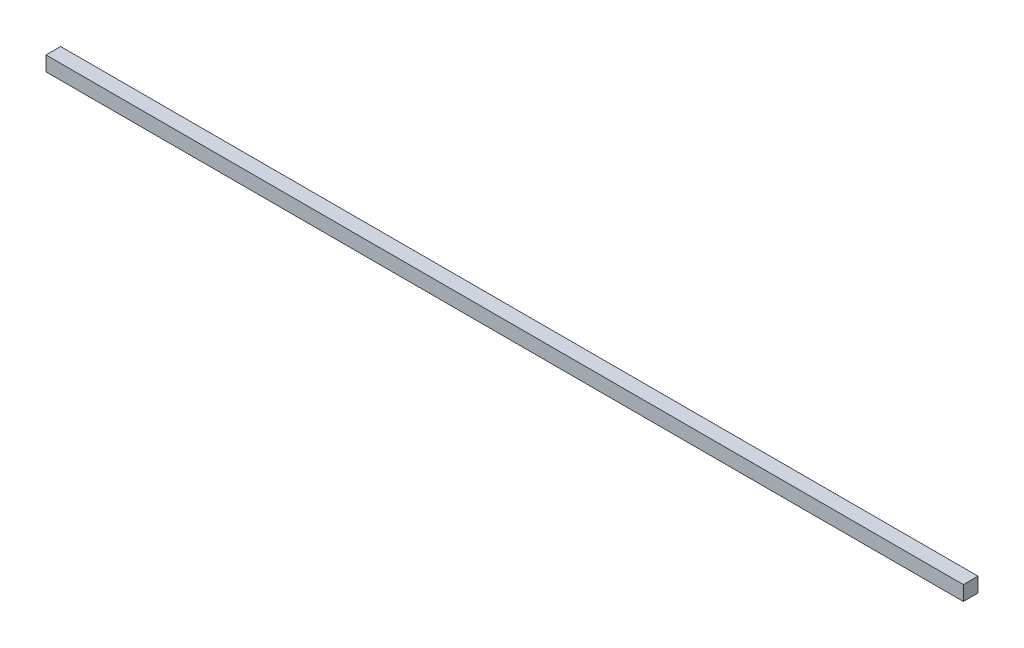
ISO-10303-21;
HEADER;
FILE_DESCRIPTION(('STEP AP214'),'2;1');
FILE_NAME('part.step','',(''),(''),'','','');
FILE_SCHEMA(('AUTOMOTIVE_DESIGN { 1 0 10303 214 1 1 1 1 }'));
ENDSEC;
DATA;
#1=APPLICATION_CONTEXT('core data for automotive mechanical design processes');
#2=APPLICATION_PROTOCOL_DEFINITION('international standard','automotive_design',2000,#1);
#3=PRODUCT_CONTEXT('',#1,'mechanical');
#4=PRODUCT('Part','Part','',(#3));
#5=PRODUCT_RELATED_PRODUCT_CATEGORY('part','',(#4));
#6=PRODUCT_DEFINITION_FORMATION('','',#4);
#7=PRODUCT_DEFINITION_CONTEXT('part definition',#1,'design');
#8=PRODUCT_DEFINITION('design','',#6,#7);
#9=PRODUCT_DEFINITION_SHAPE('','',#8);
#10=(LENGTH_UNIT() NAMED_UNIT(*) SI_UNIT(.MILLI.,.METRE.));
#11=(NAMED_UNIT(*) PLANE_ANGLE_UNIT() SI_UNIT($,.RADIAN.));
#12=(NAMED_UNIT(*) SI_UNIT($,.STERADIAN.) SOLID_ANGLE_UNIT());
#13=UNCERTAINTY_MEASURE_WITH_UNIT(LENGTH_MEASURE(1.E-05),#10,'distance_accuracy_value','');
#14=(GEOMETRIC_REPRESENTATION_CONTEXT(3) GLOBAL_UNCERTAINTY_ASSIGNED_CONTEXT((#13)) GLOBAL_UNIT_ASSIGNED_CONTEXT((#10,
#11,#12)) REPRESENTATION_CONTEXT('',''));
#15=CARTESIAN_POINT('',(0.,0.,0.));
#16=DIRECTION('',(0.,0.,1.));
#17=DIRECTION('',(1.,0.,0.));
#18=AXIS2_PLACEMENT_3D('',#15,#16,#17);
#19=CARTESIAN_POINT('',(-298.45,0.,0.));
#20=DIRECTION('',(0.,0.,-1.));
#21=DIRECTION('',(1.,0.,0.));
#22=AXIS2_PLACEMENT_3D('',#19,#20,#21);
#23=PLANE('',#22);
#24=DIRECTION('',(0.,-1.,0.));
#25=VECTOR('',#24,1.);
#26=CARTESIAN_POINT('',(0.,0.,0.));
#27=LINE('',#26,#25);
#28=CARTESIAN_POINT('',(0.,4.7625,0.));
#29=VERTEX_POINT('',#28);
#30=CARTESIAN_POINT('',(0.,0.,0.));
#31=VERTEX_POINT('',#30);
#32=EDGE_CURVE('E105',#29,#31,#27,.T.);
#33=ORIENTED_EDGE('',*,*,#32,.T.);
#34=DIRECTION('',(1.,0.,0.));
#35=VECTOR('',#34,1.);
#36=CARTESIAN_POINT('',(-298.45,0.,0.));
#37=LINE('',#36,#35);
#38=CARTESIAN_POINT('',(-298.45,0.,0.));
#39=VERTEX_POINT('',#38);
#40=EDGE_CURVE('E44',#39,#31,#37,.T.);
#41=ORIENTED_EDGE('',*,*,#40,.F.);
#42=DIRECTION('',(0.,-1.,0.));
#43=VECTOR('',#42,1.);
#44=CARTESIAN_POINT('',(-298.45,0.,0.));
#45=LINE('',#44,#43);
#46=CARTESIAN_POINT('',(-298.45,4.7625,0.));
#47=VERTEX_POINT('',#46);
#48=EDGE_CURVE('E94',#47,#39,#45,.T.);
#49=ORIENTED_EDGE('',*,*,#48,.F.);
#50=DIRECTION('',(1.,0.,0.));
#51=VECTOR('',#50,1.);
#52=CARTESIAN_POINT('',(-298.45,4.7625,0.));
#53=LINE('',#52,#51);
#54=EDGE_CURVE('E11',#47,#29,#53,.T.);
#55=ORIENTED_EDGE('',*,*,#54,.T.);
#56=EDGE_LOOP('',(#33,#41,#49,#55));
#57=FACE_BOUND('',#56,.T.);
#58=ADVANCED_FACE('F41',(#57),#23,.T.);
#59=CARTESIAN_POINT('',(-298.45,4.7625,0.));
#60=DIRECTION('',(0.,1.,0.));
#61=DIRECTION('',(0.,0.,-1.));
#62=AXIS2_PLACEMENT_3D('',#59,#60,#61);
#63=PLANE('',#62);
#64=DIRECTION('',(0.,0.,-1.));
#65=VECTOR('',#64,1.);
#66=CARTESIAN_POINT('',(0.,4.7625,0.));
#67=LINE('',#66,#65);
#68=CARTESIAN_POINT('',(0.,4.7625,4.7625));
#69=VERTEX_POINT('',#68);
#70=EDGE_CURVE('E82',#69,#29,#67,.T.);
#71=ORIENTED_EDGE('',*,*,#70,.T.);
#72=ORIENTED_EDGE('',*,*,#54,.F.);
#73=DIRECTION('',(0.,0.,-1.));
#74=VECTOR('',#73,1.);
#75=CARTESIAN_POINT('',(-298.45,4.7625,0.));
#76=LINE('',#75,#74);
#77=CARTESIAN_POINT('',(-298.45,4.7625,4.7625));
#78=VERTEX_POINT('',#77);
#79=EDGE_CURVE('E59',#78,#47,#76,.T.);
#80=ORIENTED_EDGE('',*,*,#79,.F.);
#81=DIRECTION('',(1.,0.,0.));
#82=VECTOR('',#81,1.);
#83=CARTESIAN_POINT('',(-298.45,4.7625,4.7625));
#84=LINE('',#83,#82);
#85=EDGE_CURVE('E50',#78,#69,#84,.T.);
#86=ORIENTED_EDGE('',*,*,#85,.T.);
#87=EDGE_LOOP('',(#71,#72,#80,#86));
#88=FACE_BOUND('',#87,.T.);
#89=ADVANCED_FACE('F111',(#88),#63,.T.);
#90=CARTESIAN_POINT('',(-298.45,0.,4.7625));
#91=DIRECTION('',(0.,0.,1.));
#92=DIRECTION('',(-1.,0.,0.));
#93=AXIS2_PLACEMENT_3D('',#90,#91,#92);
#94=PLANE('',#93);
#95=DIRECTION('',(0.,1.,0.));
#96=VECTOR('',#95,1.);
#97=CARTESIAN_POINT('',(0.,0.,4.7625));
#98=LINE('',#97,#96);
#99=CARTESIAN_POINT('',(0.,0.,4.7625));
#100=VERTEX_POINT('',#99);
#101=EDGE_CURVE('E76',#100,#69,#98,.T.);
#102=ORIENTED_EDGE('',*,*,#101,.T.);
#103=ORIENTED_EDGE('',*,*,#85,.F.);
#104=DIRECTION('',(0.,1.,0.));
#105=VECTOR('',#104,1.);
#106=CARTESIAN_POINT('',(-298.45,0.,4.7625));
#107=LINE('',#106,#105);
#108=CARTESIAN_POINT('',(-298.45,0.,4.7625));
#109=VERTEX_POINT('',#108);
#110=EDGE_CURVE('E92',#109,#78,#107,.T.);
#111=ORIENTED_EDGE('',*,*,#110,.F.);
#112=DIRECTION('',(1.,0.,0.));
#113=VECTOR('',#112,1.);
#114=CARTESIAN_POINT('',(-298.45,0.,4.7625));
#115=LINE('',#114,#113);
#116=EDGE_CURVE('E97',#109,#100,#115,.T.);
#117=ORIENTED_EDGE('',*,*,#116,.T.);
#118=EDGE_LOOP('',(#102,#103,#111,#117));
#119=FACE_BOUND('',#118,.T.);
#120=ADVANCED_FACE('F100',(#119),#94,.T.);
#121=CARTESIAN_POINT('',(-298.45,0.,0.));
#122=DIRECTION('',(0.,-1.,0.));
#123=DIRECTION('',(0.,0.,1.));
#124=AXIS2_PLACEMENT_3D('',#121,#122,#123);
#125=PLANE('',#124);
#126=DIRECTION('',(0.,0.,1.));
#127=VECTOR('',#126,1.);
#128=CARTESIAN_POINT('',(0.,0.,0.));
#129=LINE('',#128,#127);
#130=EDGE_CURVE('E99',#31,#100,#129,.T.);
#131=ORIENTED_EDGE('',*,*,#130,.T.);
#132=ORIENTED_EDGE('',*,*,#116,.F.);
#133=DIRECTION('',(0.,0.,1.));
#134=VECTOR('',#133,1.);
#135=CARTESIAN_POINT('',(-298.45,0.,0.));
#136=LINE('',#135,#134);
#137=EDGE_CURVE('E89',#39,#109,#136,.T.);
#138=ORIENTED_EDGE('',*,*,#137,.F.);
#139=ORIENTED_EDGE('',*,*,#40,.T.);
#140=EDGE_LOOP('',(#131,#132,#138,#139));
#141=FACE_BOUND('',#140,.T.);
#142=ADVANCED_FACE('F98',(#141),#125,.T.);
#143=CARTESIAN_POINT('',(-298.45,0.,0.));
#144=DIRECTION('',(-1.,0.,0.));
#145=DIRECTION('',(0.,0.,-1.));
#146=AXIS2_PLACEMENT_3D('',#143,#144,#145);
#147=PLANE('',#146);
#148=ORIENTED_EDGE('',*,*,#48,.T.);
#149=ORIENTED_EDGE('',*,*,#137,.T.);
#150=ORIENTED_EDGE('',*,*,#110,.T.);
#151=ORIENTED_EDGE('',*,*,#79,.T.);
#152=EDGE_LOOP('',(#148,#149,#150,#151));
#153=FACE_BOUND('',#152,.T.);
#154=ADVANCED_FACE('F90',(#153),#147,.T.);
#155=CARTESIAN_POINT('',(0.,0.,0.));
#156=DIRECTION('',(-1.,0.,0.));
#157=DIRECTION('',(0.,0.,-1.));
#158=AXIS2_PLACEMENT_3D('',#155,#156,#157);
#159=PLANE('',#158);
#160=ORIENTED_EDGE('',*,*,#32,.F.);
#161=ORIENTED_EDGE('',*,*,#70,.F.);
#162=ORIENTED_EDGE('',*,*,#101,.F.);
#163=ORIENTED_EDGE('',*,*,#130,.F.);
#164=EDGE_LOOP('',(#160,#161,#162,#163));
#165=FACE_BOUND('',#164,.T.);
#166=ADVANCED_FACE('F114',(#165),#159,.F.);
#167=CLOSED_SHELL('',(#58,#89,#120,#142,#154,#166));
#168=MANIFOLD_SOLID_BREP('B2',#167);
#169=ADVANCED_BREP_SHAPE_REPRESENTATION('',(#18,#168),#14);
#170=SHAPE_DEFINITION_REPRESENTATION(#9,#169);
ENDSEC;
END-ISO-10303-21;
